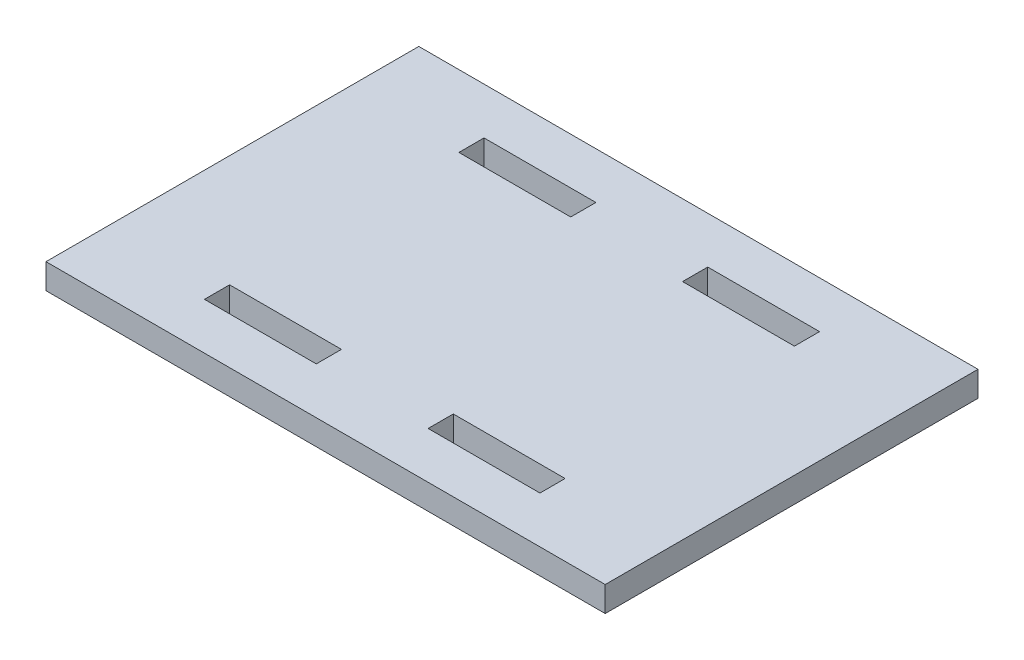
ISO-10303-21;
HEADER;
FILE_DESCRIPTION(('STEP AP214'),'2;1');
FILE_NAME('part.step','',(''),(''),'','','');
FILE_SCHEMA(('AUTOMOTIVE_DESIGN { 1 0 10303 214 1 1 1 1 }'));
ENDSEC;
DATA;
#1=APPLICATION_CONTEXT('core data for automotive mechanical design processes');
#2=APPLICATION_PROTOCOL_DEFINITION('international standard','automotive_design',2000,#1);
#3=PRODUCT_CONTEXT('',#1,'mechanical');
#4=PRODUCT('Part','Part','',(#3));
#5=PRODUCT_RELATED_PRODUCT_CATEGORY('part','',(#4));
#6=PRODUCT_DEFINITION_FORMATION('','',#4);
#7=PRODUCT_DEFINITION_CONTEXT('part definition',#1,'design');
#8=PRODUCT_DEFINITION('design','',#6,#7);
#9=PRODUCT_DEFINITION_SHAPE('','',#8);
#10=(LENGTH_UNIT() NAMED_UNIT(*) SI_UNIT(.MILLI.,.METRE.));
#11=(NAMED_UNIT(*) PLANE_ANGLE_UNIT() SI_UNIT($,.RADIAN.));
#12=(NAMED_UNIT(*) SI_UNIT($,.STERADIAN.) SOLID_ANGLE_UNIT());
#13=UNCERTAINTY_MEASURE_WITH_UNIT(LENGTH_MEASURE(1.E-05),#10,'distance_accuracy_value','');
#14=(GEOMETRIC_REPRESENTATION_CONTEXT(3) GLOBAL_UNCERTAINTY_ASSIGNED_CONTEXT((#13)) GLOBAL_UNIT_ASSIGNED_CONTEXT((#10,
#11,#12)) REPRESENTATION_CONTEXT('',''));
#15=CARTESIAN_POINT('',(0.,0.,0.));
#16=DIRECTION('',(0.,0.,1.));
#17=DIRECTION('',(1.,0.,0.));
#18=AXIS2_PLACEMENT_3D('',#15,#16,#17);
#19=CARTESIAN_POINT('',(-30.,-2.7,20.));
#20=DIRECTION('',(-1.,0.,0.));
#21=DIRECTION('',(0.,0.,1.));
#22=AXIS2_PLACEMENT_3D('',#19,#20,#21);
#23=PLANE('',#22);
#24=DIRECTION('',(0.,0.,1.));
#25=VECTOR('',#24,1.);
#26=CARTESIAN_POINT('',(-30.,0.,20.));
#27=LINE('',#26,#25);
#28=CARTESIAN_POINT('',(-30.,0.,-20.));
#29=VERTEX_POINT('',#28);
#30=CARTESIAN_POINT('',(-30.,0.,20.));
#31=VERTEX_POINT('',#30);
#32=EDGE_CURVE('E295',#29,#31,#27,.T.);
#33=ORIENTED_EDGE('',*,*,#32,.F.);
#34=DIRECTION('',(0.,1.,0.));
#35=VECTOR('',#34,1.);
#36=CARTESIAN_POINT('',(-30.,-2.7,-20.));
#37=LINE('',#36,#35);
#38=CARTESIAN_POINT('',(-30.,-2.7,-20.));
#39=VERTEX_POINT('',#38);
#40=EDGE_CURVE('E11',#39,#29,#37,.T.);
#41=ORIENTED_EDGE('',*,*,#40,.F.);
#42=DIRECTION('',(0.,0.,1.));
#43=VECTOR('',#42,1.);
#44=CARTESIAN_POINT('',(-30.,-2.7,20.));
#45=LINE('',#44,#43);
#46=CARTESIAN_POINT('',(-30.,-2.7,20.));
#47=VERTEX_POINT('',#46);
#48=EDGE_CURVE('E302',#39,#47,#45,.T.);
#49=ORIENTED_EDGE('',*,*,#48,.T.);
#50=DIRECTION('',(0.,1.,0.));
#51=VECTOR('',#50,1.);
#52=CARTESIAN_POINT('',(-30.,-2.7,20.));
#53=LINE('',#52,#51);
#54=EDGE_CURVE('E35',#47,#31,#53,.T.);
#55=ORIENTED_EDGE('',*,*,#54,.T.);
#56=EDGE_LOOP('',(#33,#41,#49,#55));
#57=FACE_BOUND('',#56,.T.);
#58=ADVANCED_FACE('F32',(#57),#23,.T.);
#59=CARTESIAN_POINT('',(30.,-2.7,-20.));
#60=DIRECTION('',(0.,0.,-1.));
#61=DIRECTION('',(-1.,0.,0.));
#62=AXIS2_PLACEMENT_3D('',#59,#60,#61);
#63=PLANE('',#62);
#64=DIRECTION('',(-1.,0.,0.));
#65=VECTOR('',#64,1.);
#66=CARTESIAN_POINT('',(30.,0.,-20.));
#67=LINE('',#66,#65);
#68=CARTESIAN_POINT('',(30.,0.,-20.));
#69=VERTEX_POINT('',#68);
#70=EDGE_CURVE('E306',#69,#29,#67,.T.);
#71=ORIENTED_EDGE('',*,*,#70,.F.);
#72=DIRECTION('',(0.,1.,0.));
#73=VECTOR('',#72,1.);
#74=CARTESIAN_POINT('',(30.,-2.7,-20.));
#75=LINE('',#74,#73);
#76=CARTESIAN_POINT('',(30.,-2.7,-20.));
#77=VERTEX_POINT('',#76);
#78=EDGE_CURVE('E40',#77,#69,#75,.T.);
#79=ORIENTED_EDGE('',*,*,#78,.F.);
#80=DIRECTION('',(-1.,0.,0.));
#81=VECTOR('',#80,1.);
#82=CARTESIAN_POINT('',(30.,-2.7,-20.));
#83=LINE('',#82,#81);
#84=EDGE_CURVE('E312',#77,#39,#83,.T.);
#85=ORIENTED_EDGE('',*,*,#84,.T.);
#86=ORIENTED_EDGE('',*,*,#40,.T.);
#87=EDGE_LOOP('',(#71,#79,#85,#86));
#88=FACE_BOUND('',#87,.T.);
#89=ADVANCED_FACE('F338',(#88),#63,.T.);
#90=CARTESIAN_POINT('',(30.,-2.7,-20.));
#91=DIRECTION('',(1.,0.,0.));
#92=DIRECTION('',(0.,0.,-1.));
#93=AXIS2_PLACEMENT_3D('',#90,#91,#92);
#94=PLANE('',#93);
#95=DIRECTION('',(0.,0.,-1.));
#96=VECTOR('',#95,1.);
#97=CARTESIAN_POINT('',(30.,0.,-20.));
#98=LINE('',#97,#96);
#99=CARTESIAN_POINT('',(30.,0.,20.));
#100=VERTEX_POINT('',#99);
#101=EDGE_CURVE('E320',#100,#69,#98,.T.);
#102=ORIENTED_EDGE('',*,*,#101,.F.);
#103=DIRECTION('',(0.,1.,0.));
#104=VECTOR('',#103,1.);
#105=CARTESIAN_POINT('',(30.,-2.7,20.));
#106=LINE('',#105,#104);
#107=CARTESIAN_POINT('',(30.,-2.7,20.));
#108=VERTEX_POINT('',#107);
#109=EDGE_CURVE('E325',#108,#100,#106,.T.);
#110=ORIENTED_EDGE('',*,*,#109,.F.);
#111=DIRECTION('',(0.,0.,-1.));
#112=VECTOR('',#111,1.);
#113=CARTESIAN_POINT('',(30.,-2.7,-20.));
#114=LINE('',#113,#112);
#115=EDGE_CURVE('E309',#108,#77,#114,.T.);
#116=ORIENTED_EDGE('',*,*,#115,.T.);
#117=ORIENTED_EDGE('',*,*,#78,.T.);
#118=EDGE_LOOP('',(#102,#110,#116,#117));
#119=FACE_BOUND('',#118,.T.);
#120=ADVANCED_FACE('F343',(#119),#94,.T.);
#121=CARTESIAN_POINT('',(30.,-2.7,20.));
#122=DIRECTION('',(0.,0.,1.));
#123=DIRECTION('',(1.,0.,0.));
#124=AXIS2_PLACEMENT_3D('',#121,#122,#123);
#125=PLANE('',#124);
#126=DIRECTION('',(1.,0.,0.));
#127=VECTOR('',#126,1.);
#128=CARTESIAN_POINT('',(30.,0.,20.));
#129=LINE('',#128,#127);
#130=EDGE_CURVE('E317',#31,#100,#129,.T.);
#131=ORIENTED_EDGE('',*,*,#130,.F.);
#132=ORIENTED_EDGE('',*,*,#54,.F.);
#133=DIRECTION('',(1.,0.,0.));
#134=VECTOR('',#133,1.);
#135=CARTESIAN_POINT('',(30.,-2.7,20.));
#136=LINE('',#135,#134);
#137=EDGE_CURVE('E305',#47,#108,#136,.T.);
#138=ORIENTED_EDGE('',*,*,#137,.T.);
#139=ORIENTED_EDGE('',*,*,#109,.T.);
#140=EDGE_LOOP('',(#131,#132,#138,#139));
#141=FACE_BOUND('',#140,.T.);
#142=ADVANCED_FACE('F333',(#141),#125,.T.);
#143=CARTESIAN_POINT('',(0.,-2.7,0.));
#144=DIRECTION('',(0.,1.,0.));
#145=DIRECTION('',(0.,0.,1.));
#146=AXIS2_PLACEMENT_3D('',#143,#144,#145);
#147=PLANE('',#146);
#148=DIRECTION('',(1.,0.,0.));
#149=VECTOR('',#148,1.);
#150=CARTESIAN_POINT('',(-6.,-2.7,15.));
#151=LINE('',#150,#149);
#152=CARTESIAN_POINT('',(-18.,-2.7,15.));
#153=VERTEX_POINT('',#152);
#154=CARTESIAN_POINT('',(-6.,-2.7,15.));
#155=VERTEX_POINT('',#154);
#156=EDGE_CURVE('E177',#153,#155,#151,.T.);
#157=ORIENTED_EDGE('',*,*,#156,.T.);
#158=DIRECTION('',(0.,0.,-1.));
#159=VECTOR('',#158,1.);
#160=CARTESIAN_POINT('',(-6.,-2.7,15.));
#161=LINE('',#160,#159);
#162=CARTESIAN_POINT('',(-6.,-2.7,12.3));
#163=VERTEX_POINT('',#162);
#164=EDGE_CURVE('E171',#155,#163,#161,.T.);
#165=ORIENTED_EDGE('',*,*,#164,.T.);
#166=DIRECTION('',(-1.,0.,0.));
#167=VECTOR('',#166,1.);
#168=CARTESIAN_POINT('',(-6.,-2.7,12.3));
#169=LINE('',#168,#167);
#170=CARTESIAN_POINT('',(-18.,-2.7,12.3));
#171=VERTEX_POINT('',#170);
#172=EDGE_CURVE('E180',#163,#171,#169,.T.);
#173=ORIENTED_EDGE('',*,*,#172,.T.);
#174=DIRECTION('',(0.,0.,1.));
#175=VECTOR('',#174,1.);
#176=CARTESIAN_POINT('',(-18.,-2.7,15.));
#177=LINE('',#176,#175);
#178=EDGE_CURVE('E48',#171,#153,#177,.T.);
#179=ORIENTED_EDGE('',*,*,#178,.T.);
#180=EDGE_LOOP('',(#157,#165,#173,#179));
#181=FACE_BOUND('',#180,.T.);
#182=DIRECTION('',(0.,0.,1.));
#183=VECTOR('',#182,1.);
#184=CARTESIAN_POINT('',(-18.,-2.7,-15.));
#185=LINE('',#184,#183);
#186=CARTESIAN_POINT('',(-18.,-2.7,-15.));
#187=VERTEX_POINT('',#186);
#188=CARTESIAN_POINT('',(-18.,-2.7,-12.3));
#189=VERTEX_POINT('',#188);
#190=EDGE_CURVE('E216',#187,#189,#185,.T.);
#191=ORIENTED_EDGE('',*,*,#190,.T.);
#192=DIRECTION('',(1.,0.,0.));
#193=VECTOR('',#192,1.);
#194=CARTESIAN_POINT('',(-6.,-2.7,-12.3));
#195=LINE('',#194,#193);
#196=CARTESIAN_POINT('',(-6.,-2.7,-12.3));
#197=VERTEX_POINT('',#196);
#198=EDGE_CURVE('E206',#189,#197,#195,.T.);
#199=ORIENTED_EDGE('',*,*,#198,.T.);
#200=DIRECTION('',(0.,0.,-1.));
#201=VECTOR('',#200,1.);
#202=CARTESIAN_POINT('',(-6.,-2.7,-15.));
#203=LINE('',#202,#201);
#204=CARTESIAN_POINT('',(-6.,-2.7,-15.));
#205=VERTEX_POINT('',#204);
#206=EDGE_CURVE('E209',#197,#205,#203,.T.);
#207=ORIENTED_EDGE('',*,*,#206,.T.);
#208=DIRECTION('',(-1.,0.,0.));
#209=VECTOR('',#208,1.);
#210=CARTESIAN_POINT('',(-6.,-2.7,-15.));
#211=LINE('',#210,#209);
#212=EDGE_CURVE('E213',#205,#187,#211,.T.);
#213=ORIENTED_EDGE('',*,*,#212,.T.);
#214=EDGE_LOOP('',(#191,#199,#207,#213));
#215=FACE_BOUND('',#214,.T.);
#216=DIRECTION('',(1.,0.,0.));
#217=VECTOR('',#216,1.);
#218=CARTESIAN_POINT('',(18.,-2.7,-12.3));
#219=LINE('',#218,#217);
#220=CARTESIAN_POINT('',(6.00000000000001,-2.7,-12.3));
#221=VERTEX_POINT('',#220);
#222=CARTESIAN_POINT('',(18.,-2.7,-12.3));
#223=VERTEX_POINT('',#222);
#224=EDGE_CURVE('E248',#221,#223,#219,.T.);
#225=ORIENTED_EDGE('',*,*,#224,.T.);
#226=DIRECTION('',(0.,0.,-1.));
#227=VECTOR('',#226,1.);
#228=CARTESIAN_POINT('',(18.,-2.7,-15.));
#229=LINE('',#228,#227);
#230=CARTESIAN_POINT('',(18.,-2.7,-15.));
#231=VERTEX_POINT('',#230);
#232=EDGE_CURVE('E238',#223,#231,#229,.T.);
#233=ORIENTED_EDGE('',*,*,#232,.T.);
#234=DIRECTION('',(-1.,0.,0.));
#235=VECTOR('',#234,1.);
#236=CARTESIAN_POINT('',(18.,-2.7,-15.));
#237=LINE('',#236,#235);
#238=CARTESIAN_POINT('',(6.00000000000001,-2.7,-15.));
#239=VERTEX_POINT('',#238);
#240=EDGE_CURVE('E241',#231,#239,#237,.T.);
#241=ORIENTED_EDGE('',*,*,#240,.T.);
#242=DIRECTION('',(0.,0.,1.));
#243=VECTOR('',#242,1.);
#244=CARTESIAN_POINT('',(6.00000000000001,-2.7,-15.));
#245=LINE('',#244,#243);
#246=EDGE_CURVE('E245',#239,#221,#245,.T.);
#247=ORIENTED_EDGE('',*,*,#246,.T.);
#248=EDGE_LOOP('',(#225,#233,#241,#247));
#249=FACE_BOUND('',#248,.T.);
#250=DIRECTION('',(0.,0.,1.));
#251=VECTOR('',#250,1.);
#252=CARTESIAN_POINT('',(6.00000000000001,-2.7,15.));
#253=LINE('',#252,#251);
#254=CARTESIAN_POINT('',(6.00000000000001,-2.7,12.3));
#255=VERTEX_POINT('',#254);
#256=CARTESIAN_POINT('',(6.00000000000001,-2.7,15.));
#257=VERTEX_POINT('',#256);
#258=EDGE_CURVE('E280',#255,#257,#253,.T.);
#259=ORIENTED_EDGE('',*,*,#258,.T.);
#260=DIRECTION('',(1.,0.,0.));
#261=VECTOR('',#260,1.);
#262=CARTESIAN_POINT('',(18.,-2.7,15.));
#263=LINE('',#262,#261);
#264=CARTESIAN_POINT('',(18.,-2.7,15.));
#265=VERTEX_POINT('',#264);
#266=EDGE_CURVE('E270',#257,#265,#263,.T.);
#267=ORIENTED_EDGE('',*,*,#266,.T.);
#268=DIRECTION('',(0.,0.,-1.));
#269=VECTOR('',#268,1.);
#270=CARTESIAN_POINT('',(18.,-2.7,15.));
#271=LINE('',#270,#269);
#272=CARTESIAN_POINT('',(18.,-2.7,12.3));
#273=VERTEX_POINT('',#272);
#274=EDGE_CURVE('E273',#265,#273,#271,.T.);
#275=ORIENTED_EDGE('',*,*,#274,.T.);
#276=DIRECTION('',(-1.,0.,0.));
#277=VECTOR('',#276,1.);
#278=CARTESIAN_POINT('',(18.,-2.7,12.3));
#279=LINE('',#278,#277);
#280=EDGE_CURVE('E277',#273,#255,#279,.T.);
#281=ORIENTED_EDGE('',*,*,#280,.T.);
#282=EDGE_LOOP('',(#259,#267,#275,#281));
#283=FACE_BOUND('',#282,.T.);
#284=ORIENTED_EDGE('',*,*,#48,.F.);
#285=ORIENTED_EDGE('',*,*,#84,.F.);
#286=ORIENTED_EDGE('',*,*,#115,.F.);
#287=ORIENTED_EDGE('',*,*,#137,.F.);
#288=EDGE_LOOP('',(#284,#285,#286,#287));
#289=FACE_BOUND('',#288,.T.);
#290=ADVANCED_FACE('F184',(#181,#215,#249,#283,#289),#147,.F.);
#291=CARTESIAN_POINT('',(0.,0.,0.));
#292=DIRECTION('',(0.,1.,0.));
#293=DIRECTION('',(0.,0.,1.));
#294=AXIS2_PLACEMENT_3D('',#291,#292,#293);
#295=PLANE('',#294);
#296=DIRECTION('',(0.,0.,-1.));
#297=VECTOR('',#296,1.);
#298=CARTESIAN_POINT('',(-6.,0.,15.));
#299=LINE('',#298,#297);
#300=CARTESIAN_POINT('',(-6.,0.,15.));
#301=VERTEX_POINT('',#300);
#302=CARTESIAN_POINT('',(-6.,0.,12.3));
#303=VERTEX_POINT('',#302);
#304=EDGE_CURVE('E56',#301,#303,#299,.T.);
#305=ORIENTED_EDGE('',*,*,#304,.F.);
#306=DIRECTION('',(1.,0.,0.));
#307=VECTOR('',#306,1.);
#308=CARTESIAN_POINT('',(-6.,0.,15.));
#309=LINE('',#308,#307);
#310=CARTESIAN_POINT('',(-18.,0.,15.));
#311=VERTEX_POINT('',#310);
#312=EDGE_CURVE('E187',#311,#301,#309,.T.);
#313=ORIENTED_EDGE('',*,*,#312,.F.);
#314=DIRECTION('',(0.,0.,1.));
#315=VECTOR('',#314,1.);
#316=CARTESIAN_POINT('',(-18.,0.,15.));
#317=LINE('',#316,#315);
#318=CARTESIAN_POINT('',(-18.,0.,12.3));
#319=VERTEX_POINT('',#318);
#320=EDGE_CURVE('E190',#319,#311,#317,.T.);
#321=ORIENTED_EDGE('',*,*,#320,.F.);
#322=DIRECTION('',(-1.,0.,0.));
#323=VECTOR('',#322,1.);
#324=CARTESIAN_POINT('',(-6.,0.,12.3));
#325=LINE('',#324,#323);
#326=EDGE_CURVE('E196',#303,#319,#325,.T.);
#327=ORIENTED_EDGE('',*,*,#326,.F.);
#328=EDGE_LOOP('',(#305,#313,#321,#327));
#329=FACE_BOUND('',#328,.T.);
#330=DIRECTION('',(1.,0.,0.));
#331=VECTOR('',#330,1.);
#332=CARTESIAN_POINT('',(-6.,0.,-12.3));
#333=LINE('',#332,#331);
#334=CARTESIAN_POINT('',(-18.,0.,-12.3));
#335=VERTEX_POINT('',#334);
#336=CARTESIAN_POINT('',(-6.,0.,-12.3));
#337=VERTEX_POINT('',#336);
#338=EDGE_CURVE('E202',#335,#337,#333,.T.);
#339=ORIENTED_EDGE('',*,*,#338,.F.);
#340=DIRECTION('',(0.,0.,1.));
#341=VECTOR('',#340,1.);
#342=CARTESIAN_POINT('',(-18.,0.,-15.));
#343=LINE('',#342,#341);
#344=CARTESIAN_POINT('',(-18.,0.,-15.));
#345=VERTEX_POINT('',#344);
#346=EDGE_CURVE('E210',#345,#335,#343,.T.);
#347=ORIENTED_EDGE('',*,*,#346,.F.);
#348=DIRECTION('',(-1.,0.,0.));
#349=VECTOR('',#348,1.);
#350=CARTESIAN_POINT('',(-6.,0.,-15.));
#351=LINE('',#350,#349);
#352=CARTESIAN_POINT('',(-6.,0.,-15.));
#353=VERTEX_POINT('',#352);
#354=EDGE_CURVE('E224',#353,#345,#351,.T.);
#355=ORIENTED_EDGE('',*,*,#354,.F.);
#356=DIRECTION('',(0.,0.,-1.));
#357=VECTOR('',#356,1.);
#358=CARTESIAN_POINT('',(-6.,0.,-15.));
#359=LINE('',#358,#357);
#360=EDGE_CURVE('E221',#337,#353,#359,.T.);
#361=ORIENTED_EDGE('',*,*,#360,.F.);
#362=EDGE_LOOP('',(#339,#347,#355,#361));
#363=FACE_BOUND('',#362,.T.);
#364=DIRECTION('',(0.,0.,-1.));
#365=VECTOR('',#364,1.);
#366=CARTESIAN_POINT('',(18.,0.,-15.));
#367=LINE('',#366,#365);
#368=CARTESIAN_POINT('',(18.,0.,-12.3));
#369=VERTEX_POINT('',#368);
#370=CARTESIAN_POINT('',(18.,0.,-15.));
#371=VERTEX_POINT('',#370);
#372=EDGE_CURVE('E231',#369,#371,#367,.T.);
#373=ORIENTED_EDGE('',*,*,#372,.F.);
#374=DIRECTION('',(1.,0.,0.));
#375=VECTOR('',#374,1.);
#376=CARTESIAN_POINT('',(18.,0.,-12.3));
#377=LINE('',#376,#375);
#378=CARTESIAN_POINT('',(6.00000000000001,0.,-12.3));
#379=VERTEX_POINT('',#378);
#380=EDGE_CURVE('E242',#379,#369,#377,.T.);
#381=ORIENTED_EDGE('',*,*,#380,.F.);
#382=DIRECTION('',(0.,0.,1.));
#383=VECTOR('',#382,1.);
#384=CARTESIAN_POINT('',(6.00000000000001,0.,-15.));
#385=LINE('',#384,#383);
#386=CARTESIAN_POINT('',(6.00000000000001,0.,-15.));
#387=VERTEX_POINT('',#386);
#388=EDGE_CURVE('E256',#387,#379,#385,.T.);
#389=ORIENTED_EDGE('',*,*,#388,.F.);
#390=DIRECTION('',(-1.,0.,0.));
#391=VECTOR('',#390,1.);
#392=CARTESIAN_POINT('',(18.,0.,-15.));
#393=LINE('',#392,#391);
#394=EDGE_CURVE('E253',#371,#387,#393,.T.);
#395=ORIENTED_EDGE('',*,*,#394,.F.);
#396=EDGE_LOOP('',(#373,#381,#389,#395));
#397=FACE_BOUND('',#396,.T.);
#398=DIRECTION('',(1.,0.,0.));
#399=VECTOR('',#398,1.);
#400=CARTESIAN_POINT('',(18.,0.,15.));
#401=LINE('',#400,#399);
#402=CARTESIAN_POINT('',(6.00000000000001,0.,15.));
#403=VERTEX_POINT('',#402);
#404=CARTESIAN_POINT('',(18.,0.,15.));
#405=VERTEX_POINT('',#404);
#406=EDGE_CURVE('E263',#403,#405,#401,.T.);
#407=ORIENTED_EDGE('',*,*,#406,.F.);
#408=DIRECTION('',(0.,0.,1.));
#409=VECTOR('',#408,1.);
#410=CARTESIAN_POINT('',(6.00000000000001,0.,15.));
#411=LINE('',#410,#409);
#412=CARTESIAN_POINT('',(6.00000000000001,0.,12.3));
#413=VERTEX_POINT('',#412);
#414=EDGE_CURVE('E274',#413,#403,#411,.T.);
#415=ORIENTED_EDGE('',*,*,#414,.F.);
#416=DIRECTION('',(-1.,0.,0.));
#417=VECTOR('',#416,1.);
#418=CARTESIAN_POINT('',(18.,0.,12.3));
#419=LINE('',#418,#417);
#420=CARTESIAN_POINT('',(18.,0.,12.3));
#421=VERTEX_POINT('',#420);
#422=EDGE_CURVE('E288',#421,#413,#419,.T.);
#423=ORIENTED_EDGE('',*,*,#422,.F.);
#424=DIRECTION('',(0.,0.,-1.));
#425=VECTOR('',#424,1.);
#426=CARTESIAN_POINT('',(18.,0.,15.));
#427=LINE('',#426,#425);
#428=EDGE_CURVE('E285',#405,#421,#427,.T.);
#429=ORIENTED_EDGE('',*,*,#428,.F.);
#430=EDGE_LOOP('',(#407,#415,#423,#429));
#431=FACE_BOUND('',#430,.T.);
#432=ORIENTED_EDGE('',*,*,#32,.T.);
#433=ORIENTED_EDGE('',*,*,#130,.T.);
#434=ORIENTED_EDGE('',*,*,#101,.T.);
#435=ORIENTED_EDGE('',*,*,#70,.T.);
#436=EDGE_LOOP('',(#432,#433,#434,#435));
#437=FACE_BOUND('',#436,.T.);
#438=ADVANCED_FACE('F335',(#329,#363,#397,#431,#437),#295,.T.);
#439=CARTESIAN_POINT('',(18.,-2.7,15.));
#440=DIRECTION('',(0.,0.,1.));
#441=DIRECTION('',(1.,0.,0.));
#442=AXIS2_PLACEMENT_3D('',#439,#440,#441);
#443=PLANE('',#442);
#444=ORIENTED_EDGE('',*,*,#406,.T.);
#445=DIRECTION('',(0.,1.,0.));
#446=VECTOR('',#445,1.);
#447=CARTESIAN_POINT('',(18.,-2.7,15.));
#448=LINE('',#447,#446);
#449=EDGE_CURVE('E283',#265,#405,#448,.T.);
#450=ORIENTED_EDGE('',*,*,#449,.F.);
#451=ORIENTED_EDGE('',*,*,#266,.F.);
#452=DIRECTION('',(0.,1.,0.));
#453=VECTOR('',#452,1.);
#454=CARTESIAN_POINT('',(6.00000000000001,-2.7,15.));
#455=LINE('',#454,#453);
#456=EDGE_CURVE('E293',#257,#403,#455,.T.);
#457=ORIENTED_EDGE('',*,*,#456,.T.);
#458=EDGE_LOOP('',(#444,#450,#451,#457));
#459=FACE_BOUND('',#458,.T.);
#460=ADVANCED_FACE('F385',(#459),#443,.F.);
#461=CARTESIAN_POINT('',(6.00000000000001,-2.7,15.));
#462=DIRECTION('',(-1.,0.,0.));
#463=DIRECTION('',(0.,0.,1.));
#464=AXIS2_PLACEMENT_3D('',#461,#462,#463);
#465=PLANE('',#464);
#466=ORIENTED_EDGE('',*,*,#414,.T.);
#467=ORIENTED_EDGE('',*,*,#456,.F.);
#468=ORIENTED_EDGE('',*,*,#258,.F.);
#469=DIRECTION('',(0.,1.,0.));
#470=VECTOR('',#469,1.);
#471=CARTESIAN_POINT('',(6.00000000000001,-2.7,12.3));
#472=LINE('',#471,#470);
#473=EDGE_CURVE('E296',#255,#413,#472,.T.);
#474=ORIENTED_EDGE('',*,*,#473,.T.);
#475=EDGE_LOOP('',(#466,#467,#468,#474));
#476=FACE_BOUND('',#475,.T.);
#477=ADVANCED_FACE('F395',(#476),#465,.F.);
#478=CARTESIAN_POINT('',(18.,-2.7,12.3));
#479=DIRECTION('',(0.,0.,-1.));
#480=DIRECTION('',(-1.,0.,0.));
#481=AXIS2_PLACEMENT_3D('',#478,#479,#480);
#482=PLANE('',#481);
#483=ORIENTED_EDGE('',*,*,#422,.T.);
#484=ORIENTED_EDGE('',*,*,#473,.F.);
#485=ORIENTED_EDGE('',*,*,#280,.F.);
#486=DIRECTION('',(0.,1.,0.));
#487=VECTOR('',#486,1.);
#488=CARTESIAN_POINT('',(18.,-2.7,12.3));
#489=LINE('',#488,#487);
#490=EDGE_CURVE('E298',#273,#421,#489,.T.);
#491=ORIENTED_EDGE('',*,*,#490,.T.);
#492=EDGE_LOOP('',(#483,#484,#485,#491));
#493=FACE_BOUND('',#492,.T.);
#494=ADVANCED_FACE('F405',(#493),#482,.F.);
#495=CARTESIAN_POINT('',(18.,-2.7,15.));
#496=DIRECTION('',(1.,0.,0.));
#497=DIRECTION('',(0.,0.,-1.));
#498=AXIS2_PLACEMENT_3D('',#495,#496,#497);
#499=PLANE('',#498);
#500=ORIENTED_EDGE('',*,*,#428,.T.);
#501=ORIENTED_EDGE('',*,*,#490,.F.);
#502=ORIENTED_EDGE('',*,*,#274,.F.);
#503=ORIENTED_EDGE('',*,*,#449,.T.);
#504=EDGE_LOOP('',(#500,#501,#502,#503));
#505=FACE_BOUND('',#504,.T.);
#506=ADVANCED_FACE('F415',(#505),#499,.F.);
#507=CARTESIAN_POINT('',(18.,-2.7,-15.));
#508=DIRECTION('',(1.,0.,0.));
#509=DIRECTION('',(0.,0.,-1.));
#510=AXIS2_PLACEMENT_3D('',#507,#508,#509);
#511=PLANE('',#510);
#512=ORIENTED_EDGE('',*,*,#372,.T.);
#513=DIRECTION('',(0.,1.,0.));
#514=VECTOR('',#513,1.);
#515=CARTESIAN_POINT('',(18.,-2.7,-15.));
#516=LINE('',#515,#514);
#517=EDGE_CURVE('E251',#231,#371,#516,.T.);
#518=ORIENTED_EDGE('',*,*,#517,.F.);
#519=ORIENTED_EDGE('',*,*,#232,.F.);
#520=DIRECTION('',(0.,1.,0.));
#521=VECTOR('',#520,1.);
#522=CARTESIAN_POINT('',(18.,-2.7,-12.3));
#523=LINE('',#522,#521);
#524=EDGE_CURVE('E261',#223,#369,#523,.T.);
#525=ORIENTED_EDGE('',*,*,#524,.T.);
#526=EDGE_LOOP('',(#512,#518,#519,#525));
#527=FACE_BOUND('',#526,.T.);
#528=ADVANCED_FACE('F425',(#527),#511,.F.);
#529=CARTESIAN_POINT('',(18.,-2.7,-12.3));
#530=DIRECTION('',(0.,0.,1.));
#531=DIRECTION('',(1.,0.,0.));
#532=AXIS2_PLACEMENT_3D('',#529,#530,#531);
#533=PLANE('',#532);
#534=ORIENTED_EDGE('',*,*,#380,.T.);
#535=ORIENTED_EDGE('',*,*,#524,.F.);
#536=ORIENTED_EDGE('',*,*,#224,.F.);
#537=DIRECTION('',(0.,1.,0.));
#538=VECTOR('',#537,1.);
#539=CARTESIAN_POINT('',(6.00000000000001,-2.7,-12.3));
#540=LINE('',#539,#538);
#541=EDGE_CURVE('E264',#221,#379,#540,.T.);
#542=ORIENTED_EDGE('',*,*,#541,.T.);
#543=EDGE_LOOP('',(#534,#535,#536,#542));
#544=FACE_BOUND('',#543,.T.);
#545=ADVANCED_FACE('F435',(#544),#533,.F.);
#546=CARTESIAN_POINT('',(6.00000000000001,-2.7,-15.));
#547=DIRECTION('',(-1.,0.,0.));
#548=DIRECTION('',(0.,0.,1.));
#549=AXIS2_PLACEMENT_3D('',#546,#547,#548);
#550=PLANE('',#549);
#551=ORIENTED_EDGE('',*,*,#388,.T.);
#552=ORIENTED_EDGE('',*,*,#541,.F.);
#553=ORIENTED_EDGE('',*,*,#246,.F.);
#554=DIRECTION('',(0.,1.,0.));
#555=VECTOR('',#554,1.);
#556=CARTESIAN_POINT('',(6.00000000000001,-2.7,-15.));
#557=LINE('',#556,#555);
#558=EDGE_CURVE('E266',#239,#387,#557,.T.);
#559=ORIENTED_EDGE('',*,*,#558,.T.);
#560=EDGE_LOOP('',(#551,#552,#553,#559));
#561=FACE_BOUND('',#560,.T.);
#562=ADVANCED_FACE('F445',(#561),#550,.F.);
#563=CARTESIAN_POINT('',(18.,-2.7,-15.));
#564=DIRECTION('',(0.,0.,-1.));
#565=DIRECTION('',(-1.,0.,0.));
#566=AXIS2_PLACEMENT_3D('',#563,#564,#565);
#567=PLANE('',#566);
#568=ORIENTED_EDGE('',*,*,#394,.T.);
#569=ORIENTED_EDGE('',*,*,#558,.F.);
#570=ORIENTED_EDGE('',*,*,#240,.F.);
#571=ORIENTED_EDGE('',*,*,#517,.T.);
#572=EDGE_LOOP('',(#568,#569,#570,#571));
#573=FACE_BOUND('',#572,.T.);
#574=ADVANCED_FACE('F455',(#573),#567,.F.);
#575=CARTESIAN_POINT('',(-6.,-2.7,-12.3));
#576=DIRECTION('',(0.,0.,1.));
#577=DIRECTION('',(1.,0.,0.));
#578=AXIS2_PLACEMENT_3D('',#575,#576,#577);
#579=PLANE('',#578);
#580=ORIENTED_EDGE('',*,*,#338,.T.);
#581=DIRECTION('',(0.,1.,0.));
#582=VECTOR('',#581,1.);
#583=CARTESIAN_POINT('',(-6.,-2.7,-12.3));
#584=LINE('',#583,#582);
#585=EDGE_CURVE('E219',#197,#337,#584,.T.);
#586=ORIENTED_EDGE('',*,*,#585,.F.);
#587=ORIENTED_EDGE('',*,*,#198,.F.);
#588=DIRECTION('',(0.,1.,0.));
#589=VECTOR('',#588,1.);
#590=CARTESIAN_POINT('',(-18.,-2.7,-12.3));
#591=LINE('',#590,#589);
#592=EDGE_CURVE('E229',#189,#335,#591,.T.);
#593=ORIENTED_EDGE('',*,*,#592,.T.);
#594=EDGE_LOOP('',(#580,#586,#587,#593));
#595=FACE_BOUND('',#594,.T.);
#596=ADVANCED_FACE('F465',(#595),#579,.F.);
#597=CARTESIAN_POINT('',(-18.,-2.7,-15.));
#598=DIRECTION('',(-1.,0.,0.));
#599=DIRECTION('',(0.,0.,1.));
#600=AXIS2_PLACEMENT_3D('',#597,#598,#599);
#601=PLANE('',#600);
#602=ORIENTED_EDGE('',*,*,#346,.T.);
#603=ORIENTED_EDGE('',*,*,#592,.F.);
#604=ORIENTED_EDGE('',*,*,#190,.F.);
#605=DIRECTION('',(0.,1.,0.));
#606=VECTOR('',#605,1.);
#607=CARTESIAN_POINT('',(-18.,-2.7,-15.));
#608=LINE('',#607,#606);
#609=EDGE_CURVE('E232',#187,#345,#608,.T.);
#610=ORIENTED_EDGE('',*,*,#609,.T.);
#611=EDGE_LOOP('',(#602,#603,#604,#610));
#612=FACE_BOUND('',#611,.T.);
#613=ADVANCED_FACE('F475',(#612),#601,.F.);
#614=CARTESIAN_POINT('',(-6.,-2.7,-15.));
#615=DIRECTION('',(0.,0.,-1.));
#616=DIRECTION('',(-1.,0.,0.));
#617=AXIS2_PLACEMENT_3D('',#614,#615,#616);
#618=PLANE('',#617);
#619=ORIENTED_EDGE('',*,*,#354,.T.);
#620=ORIENTED_EDGE('',*,*,#609,.F.);
#621=ORIENTED_EDGE('',*,*,#212,.F.);
#622=DIRECTION('',(0.,1.,0.));
#623=VECTOR('',#622,1.);
#624=CARTESIAN_POINT('',(-6.,-2.7,-15.));
#625=LINE('',#624,#623);
#626=EDGE_CURVE('E234',#205,#353,#625,.T.);
#627=ORIENTED_EDGE('',*,*,#626,.T.);
#628=EDGE_LOOP('',(#619,#620,#621,#627));
#629=FACE_BOUND('',#628,.T.);
#630=ADVANCED_FACE('F485',(#629),#618,.F.);
#631=CARTESIAN_POINT('',(-6.,-2.7,-15.));
#632=DIRECTION('',(1.,0.,0.));
#633=DIRECTION('',(0.,0.,-1.));
#634=AXIS2_PLACEMENT_3D('',#631,#632,#633);
#635=PLANE('',#634);
#636=ORIENTED_EDGE('',*,*,#360,.T.);
#637=ORIENTED_EDGE('',*,*,#626,.F.);
#638=ORIENTED_EDGE('',*,*,#206,.F.);
#639=ORIENTED_EDGE('',*,*,#585,.T.);
#640=EDGE_LOOP('',(#636,#637,#638,#639));
#641=FACE_BOUND('',#640,.T.);
#642=ADVANCED_FACE('F495',(#641),#635,.F.);
#643=CARTESIAN_POINT('',(-6.,-2.7,15.));
#644=DIRECTION('',(1.,0.,0.));
#645=DIRECTION('',(0.,0.,-1.));
#646=AXIS2_PLACEMENT_3D('',#643,#644,#645);
#647=PLANE('',#646);
#648=ORIENTED_EDGE('',*,*,#304,.T.);
#649=DIRECTION('',(0.,1.,0.));
#650=VECTOR('',#649,1.);
#651=CARTESIAN_POINT('',(-6.,-2.7,12.3));
#652=LINE('',#651,#650);
#653=EDGE_CURVE('E167',#163,#303,#652,.T.);
#654=ORIENTED_EDGE('',*,*,#653,.F.);
#655=ORIENTED_EDGE('',*,*,#164,.F.);
#656=DIRECTION('',(0.,1.,0.));
#657=VECTOR('',#656,1.);
#658=CARTESIAN_POINT('',(-6.,-2.7,15.));
#659=LINE('',#658,#657);
#660=EDGE_CURVE('E200',#155,#301,#659,.T.);
#661=ORIENTED_EDGE('',*,*,#660,.T.);
#662=EDGE_LOOP('',(#648,#654,#655,#661));
#663=FACE_BOUND('',#662,.T.);
#664=ADVANCED_FACE('F169',(#663),#647,.F.);
#665=CARTESIAN_POINT('',(-6.,-2.7,15.));
#666=DIRECTION('',(0.,0.,1.));
#667=DIRECTION('',(1.,0.,0.));
#668=AXIS2_PLACEMENT_3D('',#665,#666,#667);
#669=PLANE('',#668);
#670=ORIENTED_EDGE('',*,*,#312,.T.);
#671=ORIENTED_EDGE('',*,*,#660,.F.);
#672=ORIENTED_EDGE('',*,*,#156,.F.);
#673=DIRECTION('',(0.,1.,0.));
#674=VECTOR('',#673,1.);
#675=CARTESIAN_POINT('',(-18.,-2.7,15.));
#676=LINE('',#675,#674);
#677=EDGE_CURVE('E203',#153,#311,#676,.T.);
#678=ORIENTED_EDGE('',*,*,#677,.T.);
#679=EDGE_LOOP('',(#670,#671,#672,#678));
#680=FACE_BOUND('',#679,.T.);
#681=ADVANCED_FACE('F514',(#680),#669,.F.);
#682=CARTESIAN_POINT('',(-18.,-2.7,15.));
#683=DIRECTION('',(-1.,0.,0.));
#684=DIRECTION('',(0.,0.,1.));
#685=AXIS2_PLACEMENT_3D('',#682,#683,#684);
#686=PLANE('',#685);
#687=ORIENTED_EDGE('',*,*,#320,.T.);
#688=ORIENTED_EDGE('',*,*,#677,.F.);
#689=ORIENTED_EDGE('',*,*,#178,.F.);
#690=DIRECTION('',(0.,1.,0.));
#691=VECTOR('',#690,1.);
#692=CARTESIAN_POINT('',(-18.,-2.7,12.3));
#693=LINE('',#692,#691);
#694=EDGE_CURVE('E176',#171,#319,#693,.T.);
#695=ORIENTED_EDGE('',*,*,#694,.T.);
#696=EDGE_LOOP('',(#687,#688,#689,#695));
#697=FACE_BOUND('',#696,.T.);
#698=ADVANCED_FACE('F523',(#697),#686,.F.);
#699=CARTESIAN_POINT('',(-6.,-2.7,12.3));
#700=DIRECTION('',(0.,0.,-1.));
#701=DIRECTION('',(-1.,0.,0.));
#702=AXIS2_PLACEMENT_3D('',#699,#700,#701);
#703=PLANE('',#702);
#704=ORIENTED_EDGE('',*,*,#326,.T.);
#705=ORIENTED_EDGE('',*,*,#694,.F.);
#706=ORIENTED_EDGE('',*,*,#172,.F.);
#707=ORIENTED_EDGE('',*,*,#653,.T.);
#708=EDGE_LOOP('',(#704,#705,#706,#707));
#709=FACE_BOUND('',#708,.T.);
#710=ADVANCED_FACE('F181',(#709),#703,.F.);
#711=CLOSED_SHELL('',(#58,#89,#120,#142,#290,#438,#460,#477,#494,#506,#528,#545,#562,#574,#596,
#613,#630,#642,#664,#681,#698,#710));
#712=MANIFOLD_SOLID_BREP('B2',#711);
#713=ADVANCED_BREP_SHAPE_REPRESENTATION('',(#18,#712),#14);
#714=SHAPE_DEFINITION_REPRESENTATION(#9,#713);
ENDSEC;
END-ISO-10303-21;
